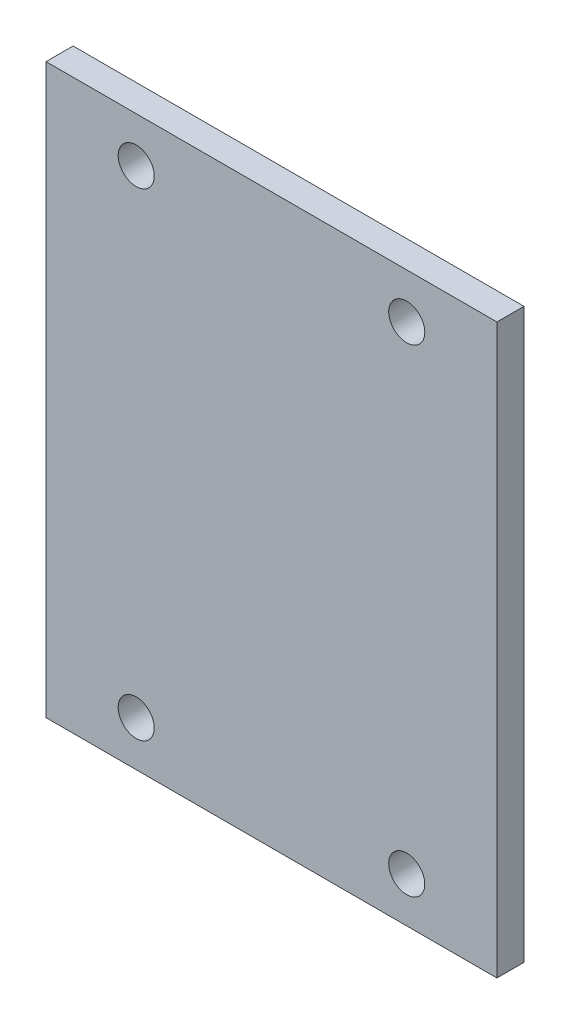
ISO-10303-21;
HEADER;
FILE_DESCRIPTION(('STEP AP214'),'2;1');
FILE_NAME('part.step','',(''),(''),'','','');
FILE_SCHEMA(('AUTOMOTIVE_DESIGN { 1 0 10303 214 1 1 1 1 }'));
ENDSEC;
DATA;
#1=APPLICATION_CONTEXT('core data for automotive mechanical design processes');
#2=APPLICATION_PROTOCOL_DEFINITION('international standard','automotive_design',2000,#1);
#3=PRODUCT_CONTEXT('',#1,'mechanical');
#4=PRODUCT('Part','Part','',(#3));
#5=PRODUCT_RELATED_PRODUCT_CATEGORY('part','',(#4));
#6=PRODUCT_DEFINITION_FORMATION('','',#4);
#7=PRODUCT_DEFINITION_CONTEXT('part definition',#1,'design');
#8=PRODUCT_DEFINITION('design','',#6,#7);
#9=PRODUCT_DEFINITION_SHAPE('','',#8);
#10=(LENGTH_UNIT() NAMED_UNIT(*) SI_UNIT(.MILLI.,.METRE.));
#11=(NAMED_UNIT(*) PLANE_ANGLE_UNIT() SI_UNIT($,.RADIAN.));
#12=(NAMED_UNIT(*) SI_UNIT($,.STERADIAN.) SOLID_ANGLE_UNIT());
#13=UNCERTAINTY_MEASURE_WITH_UNIT(LENGTH_MEASURE(1.E-05),#10,'distance_accuracy_value','');
#14=(GEOMETRIC_REPRESENTATION_CONTEXT(3) GLOBAL_UNCERTAINTY_ASSIGNED_CONTEXT((#13)) GLOBAL_UNIT_ASSIGNED_CONTEXT((#10,
#11,#12)) REPRESENTATION_CONTEXT('',''));
#15=CARTESIAN_POINT('',(0.,0.,0.));
#16=DIRECTION('',(0.,0.,1.));
#17=DIRECTION('',(1.,0.,0.));
#18=AXIS2_PLACEMENT_3D('',#15,#16,#17);
#19=CARTESIAN_POINT('',(0.,0.,3.));
#20=DIRECTION('',(0.,0.,1.));
#21=DIRECTION('',(1.,0.,0.));
#22=AXIS2_PLACEMENT_3D('',#19,#20,#21);
#23=PLANE('',#22);
#24=CARTESIAN_POINT('',(15.,-26.5,3.));
#25=DIRECTION('',(0.,0.,1.));
#26=DIRECTION('',(-1.,0.,0.));
#27=AXIS2_PLACEMENT_3D('',#24,#25,#26);
#28=CIRCLE('',#27,2.00000000000001);
#29=CARTESIAN_POINT('',(13.,-26.5,3.));
#30=VERTEX_POINT('',#29);
#31=EDGE_CURVE('E121',#30,#30,#28,.T.);
#32=ORIENTED_EDGE('',*,*,#31,.F.);
#33=EDGE_LOOP('',(#32));
#34=FACE_BOUND('',#33,.T.);
#35=CARTESIAN_POINT('',(-15.,-26.5,3.));
#36=DIRECTION('',(0.,0.,1.));
#37=DIRECTION('',(1.,0.,0.));
#38=AXIS2_PLACEMENT_3D('',#35,#36,#37);
#39=CIRCLE('',#38,2.);
#40=CARTESIAN_POINT('',(-13.,-26.5,3.));
#41=VERTEX_POINT('',#40);
#42=EDGE_CURVE('E100',#41,#41,#39,.T.);
#43=ORIENTED_EDGE('',*,*,#42,.F.);
#44=EDGE_LOOP('',(#43));
#45=FACE_BOUND('',#44,.T.);
#46=DIRECTION('',(0.,1.,0.));
#47=VECTOR('',#46,1.);
#48=CARTESIAN_POINT('',(25.,31.5,3.));
#49=LINE('',#48,#47);
#50=CARTESIAN_POINT('',(25.,-31.5,3.));
#51=VERTEX_POINT('',#50);
#52=CARTESIAN_POINT('',(25.,31.5,3.));
#53=VERTEX_POINT('',#52);
#54=EDGE_CURVE('E85',#51,#53,#49,.T.);
#55=ORIENTED_EDGE('',*,*,#54,.T.);
#56=DIRECTION('',(-1.,0.,0.));
#57=VECTOR('',#56,1.);
#58=CARTESIAN_POINT('',(-25.,31.5,3.));
#59=LINE('',#58,#57);
#60=CARTESIAN_POINT('',(-25.,31.5,3.));
#61=VERTEX_POINT('',#60);
#62=EDGE_CURVE('E80',#53,#61,#59,.T.);
#63=ORIENTED_EDGE('',*,*,#62,.T.);
#64=DIRECTION('',(0.,-1.,0.));
#65=VECTOR('',#64,1.);
#66=CARTESIAN_POINT('',(-25.,31.5,3.));
#67=LINE('',#66,#65);
#68=CARTESIAN_POINT('',(-25.,-31.5,3.));
#69=VERTEX_POINT('',#68);
#70=EDGE_CURVE('E83',#61,#69,#67,.T.);
#71=ORIENTED_EDGE('',*,*,#70,.T.);
#72=DIRECTION('',(1.,0.,0.));
#73=VECTOR('',#72,1.);
#74=CARTESIAN_POINT('',(-25.,-31.5,3.));
#75=LINE('',#74,#73);
#76=EDGE_CURVE('E50',#69,#51,#75,.T.);
#77=ORIENTED_EDGE('',*,*,#76,.T.);
#78=EDGE_LOOP('',(#55,#63,#71,#77));
#79=FACE_BOUND('',#78,.T.);
#80=CARTESIAN_POINT('',(-15.,26.5,3.));
#81=DIRECTION('',(0.,0.,1.));
#82=DIRECTION('',(-1.,0.,0.));
#83=AXIS2_PLACEMENT_3D('',#80,#81,#82);
#84=CIRCLE('',#83,2.);
#85=CARTESIAN_POINT('',(-17.,26.5,3.));
#86=VERTEX_POINT('',#85);
#87=EDGE_CURVE('E115',#86,#86,#84,.T.);
#88=ORIENTED_EDGE('',*,*,#87,.F.);
#89=EDGE_LOOP('',(#88));
#90=FACE_BOUND('',#89,.T.);
#91=CARTESIAN_POINT('',(15.,26.5,3.));
#92=DIRECTION('',(0.,0.,1.));
#93=DIRECTION('',(1.,0.,0.));
#94=AXIS2_PLACEMENT_3D('',#91,#92,#93);
#95=CIRCLE('',#94,2.);
#96=CARTESIAN_POINT('',(17.,26.5,3.));
#97=VERTEX_POINT('',#96);
#98=EDGE_CURVE('E127',#97,#97,#95,.T.);
#99=ORIENTED_EDGE('',*,*,#98,.F.);
#100=EDGE_LOOP('',(#99));
#101=FACE_BOUND('',#100,.T.);
#102=ADVANCED_FACE('F33',(#34,#45,#79,#90,#101),#23,.T.);
#103=CARTESIAN_POINT('',(0.,0.,0.));
#104=DIRECTION('',(0.,0.,1.));
#105=DIRECTION('',(1.,0.,0.));
#106=AXIS2_PLACEMENT_3D('',#103,#104,#105);
#107=PLANE('',#106);
#108=DIRECTION('',(0.,1.,0.));
#109=VECTOR('',#108,1.);
#110=CARTESIAN_POINT('',(25.,31.5,0.));
#111=LINE('',#110,#109);
#112=CARTESIAN_POINT('',(25.,-31.5,0.));
#113=VERTEX_POINT('',#112);
#114=CARTESIAN_POINT('',(25.,31.5,0.));
#115=VERTEX_POINT('',#114);
#116=EDGE_CURVE('E97',#113,#115,#111,.T.);
#117=ORIENTED_EDGE('',*,*,#116,.F.);
#118=DIRECTION('',(1.,0.,0.));
#119=VECTOR('',#118,1.);
#120=CARTESIAN_POINT('',(-25.,-31.5,0.));
#121=LINE('',#120,#119);
#122=CARTESIAN_POINT('',(-25.,-31.5,0.));
#123=VERTEX_POINT('',#122);
#124=EDGE_CURVE('E73',#123,#113,#121,.T.);
#125=ORIENTED_EDGE('',*,*,#124,.F.);
#126=DIRECTION('',(0.,-1.,0.));
#127=VECTOR('',#126,1.);
#128=CARTESIAN_POINT('',(-25.,31.5,0.));
#129=LINE('',#128,#127);
#130=CARTESIAN_POINT('',(-25.,31.5,0.));
#131=VERTEX_POINT('',#130);
#132=EDGE_CURVE('E67',#131,#123,#129,.T.);
#133=ORIENTED_EDGE('',*,*,#132,.F.);
#134=DIRECTION('',(-1.,0.,0.));
#135=VECTOR('',#134,1.);
#136=CARTESIAN_POINT('',(-25.,31.5,0.));
#137=LINE('',#136,#135);
#138=EDGE_CURVE('E89',#115,#131,#137,.T.);
#139=ORIENTED_EDGE('',*,*,#138,.F.);
#140=EDGE_LOOP('',(#117,#125,#133,#139));
#141=FACE_BOUND('',#140,.T.);
#142=CARTESIAN_POINT('',(-15.,-26.5,0.));
#143=DIRECTION('',(0.,0.,1.));
#144=DIRECTION('',(1.,0.,0.));
#145=AXIS2_PLACEMENT_3D('',#142,#143,#144);
#146=CIRCLE('',#145,2.);
#147=CARTESIAN_POINT('',(-13.,-26.5,0.));
#148=VERTEX_POINT('',#147);
#149=EDGE_CURVE('E112',#148,#148,#146,.T.);
#150=ORIENTED_EDGE('',*,*,#149,.T.);
#151=EDGE_LOOP('',(#150));
#152=FACE_BOUND('',#151,.T.);
#153=CARTESIAN_POINT('',(-15.,26.5,0.));
#154=DIRECTION('',(0.,0.,1.));
#155=DIRECTION('',(-1.,0.,0.));
#156=AXIS2_PLACEMENT_3D('',#153,#154,#155);
#157=CIRCLE('',#156,2.);
#158=CARTESIAN_POINT('',(-17.,26.5,0.));
#159=VERTEX_POINT('',#158);
#160=EDGE_CURVE('E118',#159,#159,#157,.T.);
#161=ORIENTED_EDGE('',*,*,#160,.T.);
#162=EDGE_LOOP('',(#161));
#163=FACE_BOUND('',#162,.T.);
#164=CARTESIAN_POINT('',(15.,-26.5,0.));
#165=DIRECTION('',(0.,0.,1.));
#166=DIRECTION('',(-1.,0.,0.));
#167=AXIS2_PLACEMENT_3D('',#164,#165,#166);
#168=CIRCLE('',#167,2.00000000000001);
#169=CARTESIAN_POINT('',(13.,-26.5,0.));
#170=VERTEX_POINT('',#169);
#171=EDGE_CURVE('E124',#170,#170,#168,.T.);
#172=ORIENTED_EDGE('',*,*,#171,.T.);
#173=EDGE_LOOP('',(#172));
#174=FACE_BOUND('',#173,.T.);
#175=CARTESIAN_POINT('',(15.,26.5,0.));
#176=DIRECTION('',(0.,0.,1.));
#177=DIRECTION('',(1.,0.,0.));
#178=AXIS2_PLACEMENT_3D('',#175,#176,#177);
#179=CIRCLE('',#178,2.);
#180=CARTESIAN_POINT('',(17.,26.5,0.));
#181=VERTEX_POINT('',#180);
#182=EDGE_CURVE('E130',#181,#181,#179,.T.);
#183=ORIENTED_EDGE('',*,*,#182,.T.);
#184=EDGE_LOOP('',(#183));
#185=FACE_BOUND('',#184,.T.);
#186=ADVANCED_FACE('F108',(#141,#152,#163,#174,#185),#107,.F.);
#187=CARTESIAN_POINT('',(25.,31.5,3.));
#188=DIRECTION('',(-1.,0.,0.));
#189=DIRECTION('',(0.,-1.,0.));
#190=AXIS2_PLACEMENT_3D('',#187,#188,#189);
#191=PLANE('',#190);
#192=ORIENTED_EDGE('',*,*,#116,.T.);
#193=DIRECTION('',(0.,0.,-1.));
#194=VECTOR('',#193,1.);
#195=CARTESIAN_POINT('',(25.,31.5,3.));
#196=LINE('',#195,#194);
#197=EDGE_CURVE('E11',#53,#115,#196,.T.);
#198=ORIENTED_EDGE('',*,*,#197,.F.);
#199=ORIENTED_EDGE('',*,*,#54,.F.);
#200=DIRECTION('',(0.,0.,-1.));
#201=VECTOR('',#200,1.);
#202=CARTESIAN_POINT('',(25.,-31.5,3.));
#203=LINE('',#202,#201);
#204=EDGE_CURVE('E93',#51,#113,#203,.T.);
#205=ORIENTED_EDGE('',*,*,#204,.T.);
#206=EDGE_LOOP('',(#192,#198,#199,#205));
#207=FACE_BOUND('',#206,.T.);
#208=ADVANCED_FACE('F35',(#207),#191,.F.);
#209=CARTESIAN_POINT('',(-25.,31.5,3.));
#210=DIRECTION('',(0.,-1.,0.));
#211=DIRECTION('',(0.,0.,-1.));
#212=AXIS2_PLACEMENT_3D('',#209,#210,#211);
#213=PLANE('',#212);
#214=ORIENTED_EDGE('',*,*,#138,.T.);
#215=DIRECTION('',(0.,0.,-1.));
#216=VECTOR('',#215,1.);
#217=CARTESIAN_POINT('',(-25.,31.5,3.));
#218=LINE('',#217,#216);
#219=EDGE_CURVE('E42',#61,#131,#218,.T.);
#220=ORIENTED_EDGE('',*,*,#219,.F.);
#221=ORIENTED_EDGE('',*,*,#62,.F.);
#222=ORIENTED_EDGE('',*,*,#197,.T.);
#223=EDGE_LOOP('',(#214,#220,#221,#222));
#224=FACE_BOUND('',#223,.T.);
#225=ADVANCED_FACE('F88',(#224),#213,.F.);
#226=CARTESIAN_POINT('',(-25.,31.5,3.));
#227=DIRECTION('',(1.,0.,0.));
#228=DIRECTION('',(0.,1.,0.));
#229=AXIS2_PLACEMENT_3D('',#226,#227,#228);
#230=PLANE('',#229);
#231=ORIENTED_EDGE('',*,*,#132,.T.);
#232=DIRECTION('',(0.,0.,-1.));
#233=VECTOR('',#232,1.);
#234=CARTESIAN_POINT('',(-25.,-31.5,3.));
#235=LINE('',#234,#233);
#236=EDGE_CURVE('E90',#69,#123,#235,.T.);
#237=ORIENTED_EDGE('',*,*,#236,.F.);
#238=ORIENTED_EDGE('',*,*,#70,.F.);
#239=ORIENTED_EDGE('',*,*,#219,.T.);
#240=EDGE_LOOP('',(#231,#237,#238,#239));
#241=FACE_BOUND('',#240,.T.);
#242=ADVANCED_FACE('F91',(#241),#230,.F.);
#243=CARTESIAN_POINT('',(-25.,-31.5,3.));
#244=DIRECTION('',(0.,1.,0.));
#245=DIRECTION('',(0.,0.,1.));
#246=AXIS2_PLACEMENT_3D('',#243,#244,#245);
#247=PLANE('',#246);
#248=ORIENTED_EDGE('',*,*,#124,.T.);
#249=ORIENTED_EDGE('',*,*,#204,.F.);
#250=ORIENTED_EDGE('',*,*,#76,.F.);
#251=ORIENTED_EDGE('',*,*,#236,.T.);
#252=EDGE_LOOP('',(#248,#249,#250,#251));
#253=FACE_BOUND('',#252,.T.);
#254=ADVANCED_FACE('F105',(#253),#247,.F.);
#255=CARTESIAN_POINT('',(-15.,-26.5,3.));
#256=DIRECTION('',(0.,0.,-1.));
#257=DIRECTION('',(-1.,0.,0.));
#258=AXIS2_PLACEMENT_3D('',#255,#256,#257);
#259=CYLINDRICAL_SURFACE('',#258,2.);
#260=ORIENTED_EDGE('',*,*,#42,.T.);
#261=EDGE_LOOP('',(#260));
#262=FACE_BOUND('',#261,.T.);
#263=ORIENTED_EDGE('',*,*,#149,.F.);
#264=EDGE_LOOP('',(#263));
#265=FACE_BOUND('',#264,.T.);
#266=ADVANCED_FACE('F149',(#262,#265),#259,.F.);
#267=CARTESIAN_POINT('',(-15.,26.5,3.));
#268=DIRECTION('',(0.,0.,-1.));
#269=DIRECTION('',(-1.,0.,0.));
#270=AXIS2_PLACEMENT_3D('',#267,#268,#269);
#271=CYLINDRICAL_SURFACE('',#270,2.);
#272=ORIENTED_EDGE('',*,*,#87,.T.);
#273=EDGE_LOOP('',(#272));
#274=FACE_BOUND('',#273,.T.);
#275=ORIENTED_EDGE('',*,*,#160,.F.);
#276=EDGE_LOOP('',(#275));
#277=FACE_BOUND('',#276,.T.);
#278=ADVANCED_FACE('F195',(#274,#277),#271,.F.);
#279=CARTESIAN_POINT('',(15.,-26.5,3.));
#280=DIRECTION('',(0.,0.,-1.));
#281=DIRECTION('',(-1.,0.,0.));
#282=AXIS2_PLACEMENT_3D('',#279,#280,#281);
#283=CYLINDRICAL_SURFACE('',#282,2.00000000000001);
#284=ORIENTED_EDGE('',*,*,#31,.T.);
#285=EDGE_LOOP('',(#284));
#286=FACE_BOUND('',#285,.T.);
#287=ORIENTED_EDGE('',*,*,#171,.F.);
#288=EDGE_LOOP('',(#287));
#289=FACE_BOUND('',#288,.T.);
#290=ADVANCED_FACE('F203',(#286,#289),#283,.F.);
#291=CARTESIAN_POINT('',(15.,26.5,3.));
#292=DIRECTION('',(0.,0.,-1.));
#293=DIRECTION('',(-1.,0.,0.));
#294=AXIS2_PLACEMENT_3D('',#291,#292,#293);
#295=CYLINDRICAL_SURFACE('',#294,2.);
#296=ORIENTED_EDGE('',*,*,#98,.T.);
#297=EDGE_LOOP('',(#296));
#298=FACE_BOUND('',#297,.T.);
#299=ORIENTED_EDGE('',*,*,#182,.F.);
#300=EDGE_LOOP('',(#299));
#301=FACE_BOUND('',#300,.T.);
#302=ADVANCED_FACE('F136',(#298,#301),#295,.F.);
#303=CLOSED_SHELL('',(#102,#186,#208,#225,#242,#254,#266,#278,#290,#302));
#304=MANIFOLD_SOLID_BREP('B2',#303);
#305=ADVANCED_BREP_SHAPE_REPRESENTATION('',(#18,#304),#14);
#306=SHAPE_DEFINITION_REPRESENTATION(#9,#305);
ENDSEC;
END-ISO-10303-21;
